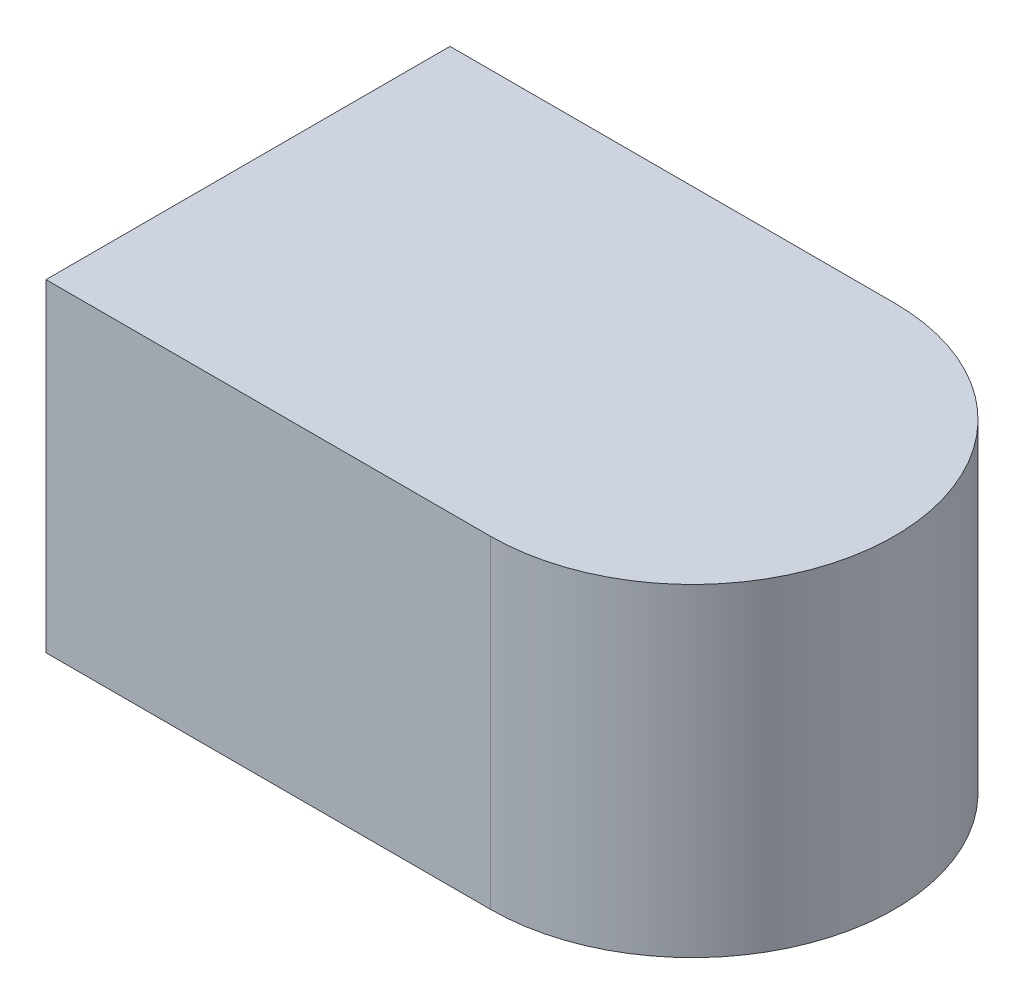
ISO-10303-21;
HEADER;
FILE_DESCRIPTION(('STEP AP214'),'2;1');
FILE_NAME('part.step','',(''),(''),'','','');
FILE_SCHEMA(('AUTOMOTIVE_DESIGN { 1 0 10303 214 1 1 1 1 }'));
ENDSEC;
DATA;
#1=APPLICATION_CONTEXT('core data for automotive mechanical design processes');
#2=APPLICATION_PROTOCOL_DEFINITION('international standard','automotive_design',2000,#1);
#3=PRODUCT_CONTEXT('',#1,'mechanical');
#4=PRODUCT('Part','Part','',(#3));
#5=PRODUCT_RELATED_PRODUCT_CATEGORY('part','',(#4));
#6=PRODUCT_DEFINITION_FORMATION('','',#4);
#7=PRODUCT_DEFINITION_CONTEXT('part definition',#1,'design');
#8=PRODUCT_DEFINITION('design','',#6,#7);
#9=PRODUCT_DEFINITION_SHAPE('','',#8);
#10=(LENGTH_UNIT() NAMED_UNIT(*) SI_UNIT(.MILLI.,.METRE.));
#11=(NAMED_UNIT(*) PLANE_ANGLE_UNIT() SI_UNIT($,.RADIAN.));
#12=(NAMED_UNIT(*) SI_UNIT($,.STERADIAN.) SOLID_ANGLE_UNIT());
#13=UNCERTAINTY_MEASURE_WITH_UNIT(LENGTH_MEASURE(1.E-05),#10,'distance_accuracy_value','');
#14=(GEOMETRIC_REPRESENTATION_CONTEXT(3) GLOBAL_UNCERTAINTY_ASSIGNED_CONTEXT((#13)) GLOBAL_UNIT_ASSIGNED_CONTEXT((#10,
#11,#12)) REPRESENTATION_CONTEXT('',''));
#15=CARTESIAN_POINT('',(0.,0.,0.));
#16=DIRECTION('',(0.,0.,1.));
#17=DIRECTION('',(1.,0.,0.));
#18=AXIS2_PLACEMENT_3D('',#15,#16,#17);
#19=CARTESIAN_POINT('',(0.,0.,0.));
#20=DIRECTION('',(0.,-1.,0.));
#21=DIRECTION('',(-1.,0.,0.));
#22=AXIS2_PLACEMENT_3D('',#19,#20,#21);
#23=PLANE('',#22);
#24=CARTESIAN_POINT('',(-1.225,0.,-0.75));
#25=DIRECTION('',(0.,-1.,0.));
#26=DIRECTION('',(0.,0.,-1.));
#27=AXIS2_PLACEMENT_3D('',#24,#25,#26);
#28=CIRCLE('',#27,0.125);
#29=CARTESIAN_POINT('',(-1.225,0.,-0.875));
#30=VERTEX_POINT('',#29);
#31=CARTESIAN_POINT('',(-1.225,0.,-0.625));
#32=VERTEX_POINT('',#31);
#33=EDGE_CURVE('E11',#30,#32,#28,.T.);
#34=ORIENTED_EDGE('',*,*,#33,.T.);
#35=DIRECTION('',(-1.,0.,0.));
#36=VECTOR('',#35,1.);
#37=CARTESIAN_POINT('',(-1.225,0.,-0.625));
#38=LINE('',#37,#36);
#39=CARTESIAN_POINT('',(-1.5,0.,-0.625));
#40=VERTEX_POINT('',#39);
#41=EDGE_CURVE('E24',#32,#40,#38,.T.);
#42=ORIENTED_EDGE('',*,*,#41,.T.);
#43=DIRECTION('',(0.,0.,-1.));
#44=VECTOR('',#43,1.);
#45=CARTESIAN_POINT('',(-1.5,0.,-0.625));
#46=LINE('',#45,#44);
#47=CARTESIAN_POINT('',(-1.5,0.,-0.875));
#48=VERTEX_POINT('',#47);
#49=EDGE_CURVE('E62',#40,#48,#46,.T.);
#50=ORIENTED_EDGE('',*,*,#49,.T.);
#51=DIRECTION('',(1.,0.,0.));
#52=VECTOR('',#51,1.);
#53=CARTESIAN_POINT('',(-1.5,0.,-0.875));
#54=LINE('',#53,#52);
#55=EDGE_CURVE('E36',#48,#30,#54,.T.);
#56=ORIENTED_EDGE('',*,*,#55,.T.);
#57=EDGE_LOOP('',(#34,#42,#50,#56));
#58=FACE_BOUND('',#57,.T.);
#59=ADVANCED_FACE('F17',(#58),#23,.T.);
#60=CARTESIAN_POINT('',(-1.5,0.,-0.875));
#61=DIRECTION('',(0.,0.,1.));
#62=DIRECTION('',(1.,0.,0.));
#63=AXIS2_PLACEMENT_3D('',#60,#61,#62);
#64=PLANE('',#63);
#65=DIRECTION('',(0.,1.,0.));
#66=VECTOR('',#65,1.);
#67=CARTESIAN_POINT('',(-1.5,0.,-0.875));
#68=LINE('',#67,#66);
#69=CARTESIAN_POINT('',(-1.5,0.2,-0.875));
#70=VERTEX_POINT('',#69);
#71=EDGE_CURVE('E84',#48,#70,#68,.T.);
#72=ORIENTED_EDGE('',*,*,#71,.T.);
#73=DIRECTION('',(1.,0.,0.));
#74=VECTOR('',#73,1.);
#75=CARTESIAN_POINT('',(-1.5,0.2,-0.875));
#76=LINE('',#75,#74);
#77=CARTESIAN_POINT('',(-1.225,0.2,-0.875));
#78=VERTEX_POINT('',#77);
#79=EDGE_CURVE('E74',#70,#78,#76,.T.);
#80=ORIENTED_EDGE('',*,*,#79,.T.);
#81=DIRECTION('',(0.,1.,0.));
#82=VECTOR('',#81,1.);
#83=CARTESIAN_POINT('',(-1.225,0.,-0.875));
#84=LINE('',#83,#82);
#85=EDGE_CURVE('E81',#30,#78,#84,.T.);
#86=ORIENTED_EDGE('',*,*,#85,.F.);
#87=ORIENTED_EDGE('',*,*,#55,.F.);
#88=EDGE_LOOP('',(#72,#80,#86,#87));
#89=FACE_BOUND('',#88,.T.);
#90=ADVANCED_FACE('F91',(#89),#64,.F.);
#91=CARTESIAN_POINT('',(-1.225,0.,-0.75));
#92=DIRECTION('',(0.,-1.,0.));
#93=DIRECTION('',(-1.,0.,0.));
#94=AXIS2_PLACEMENT_3D('',#91,#92,#93);
#95=CYLINDRICAL_SURFACE('',#94,0.125);
#96=ORIENTED_EDGE('',*,*,#85,.T.);
#97=CARTESIAN_POINT('',(-1.225,0.2,-0.75));
#98=DIRECTION('',(0.,-1.,0.));
#99=DIRECTION('',(0.,0.,-1.));
#100=AXIS2_PLACEMENT_3D('',#97,#98,#99);
#101=CIRCLE('',#100,0.125);
#102=CARTESIAN_POINT('',(-1.225,0.2,-0.625));
#103=VERTEX_POINT('',#102);
#104=EDGE_CURVE('E79',#78,#103,#101,.T.);
#105=ORIENTED_EDGE('',*,*,#104,.T.);
#106=DIRECTION('',(0.,1.,0.));
#107=VECTOR('',#106,1.);
#108=CARTESIAN_POINT('',(-1.225,0.,-0.625));
#109=LINE('',#108,#107);
#110=EDGE_CURVE('E68',#32,#103,#109,.T.);
#111=ORIENTED_EDGE('',*,*,#110,.F.);
#112=ORIENTED_EDGE('',*,*,#33,.F.);
#113=EDGE_LOOP('',(#96,#105,#111,#112));
#114=FACE_BOUND('',#113,.T.);
#115=ADVANCED_FACE('F89',(#114),#95,.T.);
#116=CARTESIAN_POINT('',(-1.225,0.,-0.625));
#117=DIRECTION('',(0.,0.,-1.));
#118=DIRECTION('',(-1.,0.,0.));
#119=AXIS2_PLACEMENT_3D('',#116,#117,#118);
#120=PLANE('',#119);
#121=ORIENTED_EDGE('',*,*,#110,.T.);
#122=DIRECTION('',(-1.,0.,0.));
#123=VECTOR('',#122,1.);
#124=CARTESIAN_POINT('',(-1.225,0.2,-0.625));
#125=LINE('',#124,#123);
#126=CARTESIAN_POINT('',(-1.5,0.2,-0.625));
#127=VERTEX_POINT('',#126);
#128=EDGE_CURVE('E63',#103,#127,#125,.T.);
#129=ORIENTED_EDGE('',*,*,#128,.T.);
#130=DIRECTION('',(0.,1.,0.));
#131=VECTOR('',#130,1.);
#132=CARTESIAN_POINT('',(-1.5,0.,-0.625));
#133=LINE('',#132,#131);
#134=EDGE_CURVE('E56',#40,#127,#133,.T.);
#135=ORIENTED_EDGE('',*,*,#134,.F.);
#136=ORIENTED_EDGE('',*,*,#41,.F.);
#137=EDGE_LOOP('',(#121,#129,#135,#136));
#138=FACE_BOUND('',#137,.T.);
#139=ADVANCED_FACE('F66',(#138),#120,.F.);
#140=CARTESIAN_POINT('',(-1.5,0.,-0.625));
#141=DIRECTION('',(1.,0.,0.));
#142=DIRECTION('',(0.,0.,-1.));
#143=AXIS2_PLACEMENT_3D('',#140,#141,#142);
#144=PLANE('',#143);
#145=ORIENTED_EDGE('',*,*,#134,.T.);
#146=DIRECTION('',(0.,0.,-1.));
#147=VECTOR('',#146,1.);
#148=CARTESIAN_POINT('',(-1.5,0.2,-0.625));
#149=LINE('',#148,#147);
#150=EDGE_CURVE('E61',#127,#70,#149,.T.);
#151=ORIENTED_EDGE('',*,*,#150,.T.);
#152=ORIENTED_EDGE('',*,*,#71,.F.);
#153=ORIENTED_EDGE('',*,*,#49,.F.);
#154=EDGE_LOOP('',(#145,#151,#152,#153));
#155=FACE_BOUND('',#154,.T.);
#156=ADVANCED_FACE('F58',(#155),#144,.F.);
#157=CARTESIAN_POINT('',(0.,0.2,0.));
#158=DIRECTION('',(0.,-1.,0.));
#159=DIRECTION('',(-1.,0.,0.));
#160=AXIS2_PLACEMENT_3D('',#157,#158,#159);
#161=PLANE('',#160);
#162=ORIENTED_EDGE('',*,*,#150,.F.);
#163=ORIENTED_EDGE('',*,*,#128,.F.);
#164=ORIENTED_EDGE('',*,*,#104,.F.);
#165=ORIENTED_EDGE('',*,*,#79,.F.);
#166=EDGE_LOOP('',(#162,#163,#164,#165));
#167=FACE_BOUND('',#166,.T.);
#168=ADVANCED_FACE('F72',(#167),#161,.F.);
#169=CLOSED_SHELL('',(#59,#90,#115,#139,#156,#168));
#170=MANIFOLD_SOLID_BREP('B1',#169);
#171=ADVANCED_BREP_SHAPE_REPRESENTATION('',(#18,#170),#14);
#172=SHAPE_DEFINITION_REPRESENTATION(#9,#171);
ENDSEC;
END-ISO-10303-21;
